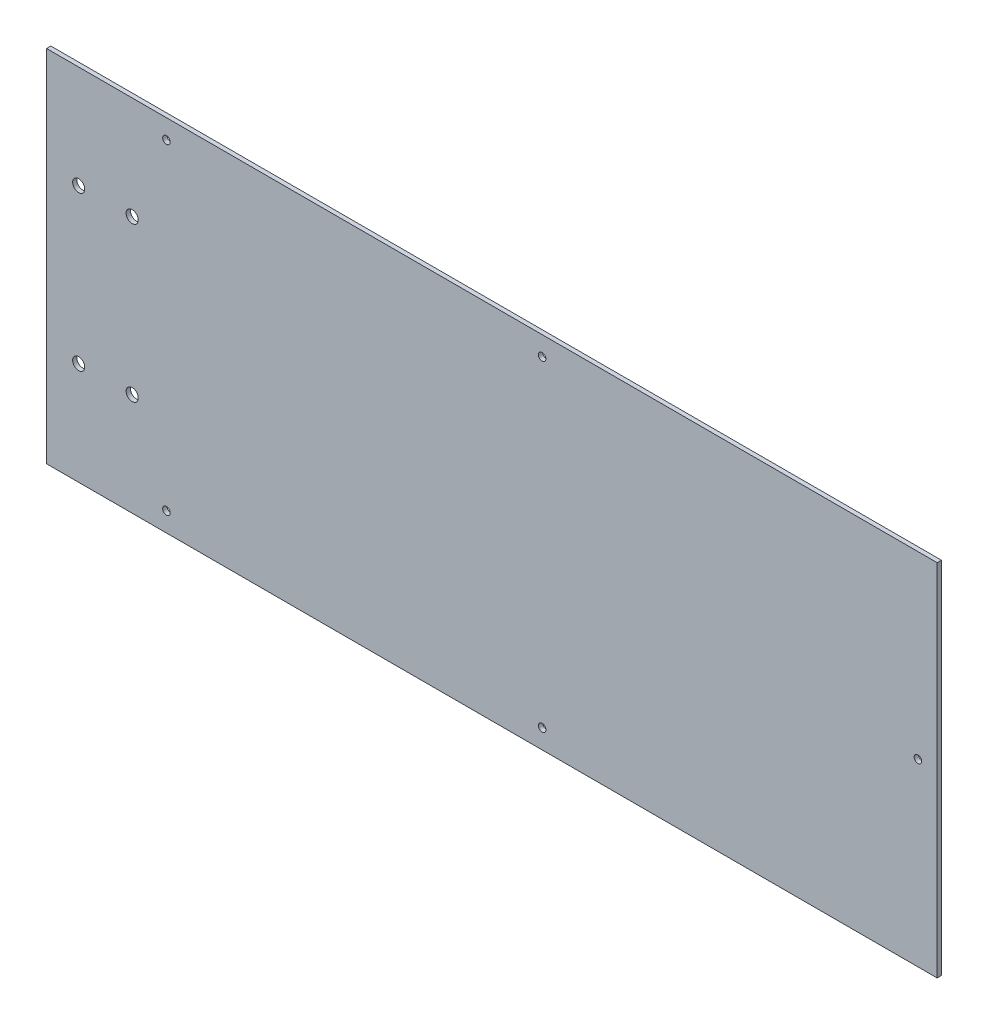
ISO-10303-21;
HEADER;
FILE_DESCRIPTION(('STEP AP214'),'2;1');
FILE_NAME('part.step','',(''),(''),'','','');
FILE_SCHEMA(('AUTOMOTIVE_DESIGN { 1 0 10303 214 1 1 1 1 }'));
ENDSEC;
DATA;
#1=APPLICATION_CONTEXT('core data for automotive mechanical design processes');
#2=APPLICATION_PROTOCOL_DEFINITION('international standard','automotive_design',2000,#1);
#3=PRODUCT_CONTEXT('',#1,'mechanical');
#4=PRODUCT('Part','Part','',(#3));
#5=PRODUCT_RELATED_PRODUCT_CATEGORY('part','',(#4));
#6=PRODUCT_DEFINITION_FORMATION('','',#4);
#7=PRODUCT_DEFINITION_CONTEXT('part definition',#1,'design');
#8=PRODUCT_DEFINITION('design','',#6,#7);
#9=PRODUCT_DEFINITION_SHAPE('','',#8);
#10=(LENGTH_UNIT() NAMED_UNIT(*) SI_UNIT(.MILLI.,.METRE.));
#11=(NAMED_UNIT(*) PLANE_ANGLE_UNIT() SI_UNIT($,.RADIAN.));
#12=(NAMED_UNIT(*) SI_UNIT($,.STERADIAN.) SOLID_ANGLE_UNIT());
#13=UNCERTAINTY_MEASURE_WITH_UNIT(LENGTH_MEASURE(1.E-05),#10,'distance_accuracy_value','');
#14=(GEOMETRIC_REPRESENTATION_CONTEXT(3) GLOBAL_UNCERTAINTY_ASSIGNED_CONTEXT((#13)) GLOBAL_UNIT_ASSIGNED_CONTEXT((#10,
#11,#12)) REPRESENTATION_CONTEXT('',''));
#15=CARTESIAN_POINT('',(0.,0.,0.));
#16=DIRECTION('',(0.,0.,1.));
#17=DIRECTION('',(1.,0.,0.));
#18=AXIS2_PLACEMENT_3D('',#15,#16,#17);
#19=CARTESIAN_POINT('',(0.,0.,1.5875));
#20=DIRECTION('',(0.,0.,-1.));
#21=DIRECTION('',(-1.,0.,0.));
#22=AXIS2_PLACEMENT_3D('',#19,#20,#21);
#23=PLANE('',#22);
#24=DIRECTION('',(0.,-1.,0.));
#25=VECTOR('',#24,1.);
#26=CARTESIAN_POINT('',(0.,0.,1.5875));
#27=LINE('',#26,#25);
#28=CARTESIAN_POINT('',(0.,133.35,1.5875));
#29=VERTEX_POINT('',#28);
#30=CARTESIAN_POINT('',(0.,0.,1.5875));
#31=VERTEX_POINT('',#30);
#32=EDGE_CURVE('E87',#29,#31,#27,.T.);
#33=ORIENTED_EDGE('',*,*,#32,.T.);
#34=DIRECTION('',(1.,0.,0.));
#35=VECTOR('',#34,1.);
#36=CARTESIAN_POINT('',(0.,0.,1.5875));
#37=LINE('',#36,#35);
#38=CARTESIAN_POINT('',(330.2,0.,1.5875));
#39=VERTEX_POINT('',#38);
#40=EDGE_CURVE('E82',#31,#39,#37,.T.);
#41=ORIENTED_EDGE('',*,*,#40,.T.);
#42=DIRECTION('',(0.,1.,0.));
#43=VECTOR('',#42,1.);
#44=CARTESIAN_POINT('',(330.2,0.,1.5875));
#45=LINE('',#44,#43);
#46=CARTESIAN_POINT('',(330.2,133.35,1.5875));
#47=VERTEX_POINT('',#46);
#48=EDGE_CURVE('E85',#39,#47,#45,.T.);
#49=ORIENTED_EDGE('',*,*,#48,.T.);
#50=DIRECTION('',(-1.,0.,0.));
#51=VECTOR('',#50,1.);
#52=CARTESIAN_POINT('',(0.,133.35,1.5875));
#53=LINE('',#52,#51);
#54=EDGE_CURVE('E52',#47,#29,#53,.T.);
#55=ORIENTED_EDGE('',*,*,#54,.T.);
#56=EDGE_LOOP('',(#33,#41,#49,#55));
#57=FACE_BOUND('',#56,.T.);
#58=CARTESIAN_POINT('',(323.0626,66.675,1.5875));
#59=DIRECTION('',(0.,0.,1.));
#60=DIRECTION('',(1.,0.,0.));
#61=AXIS2_PLACEMENT_3D('',#58,#59,#60);
#62=CIRCLE('',#61,1.39699999999999);
#63=CARTESIAN_POINT('',(324.4596,66.675,1.5875));
#64=VERTEX_POINT('',#63);
#65=EDGE_CURVE('E102',#64,#64,#62,.T.);
#66=ORIENTED_EDGE('',*,*,#65,.F.);
#67=EDGE_LOOP('',(#66));
#68=FACE_BOUND('',#67,.T.);
#69=CARTESIAN_POINT('',(183.7436,126.2126,1.5875));
#70=DIRECTION('',(0.,0.,1.));
#71=DIRECTION('',(1.,0.,0.));
#72=AXIS2_PLACEMENT_3D('',#69,#70,#71);
#73=CIRCLE('',#72,1.39699999999999);
#74=CARTESIAN_POINT('',(185.1406,126.2126,1.5875));
#75=VERTEX_POINT('',#74);
#76=EDGE_CURVE('E117',#75,#75,#73,.T.);
#77=ORIENTED_EDGE('',*,*,#76,.F.);
#78=EDGE_LOOP('',(#77));
#79=FACE_BOUND('',#78,.T.);
#80=CARTESIAN_POINT('',(44.45,126.2126,1.5875));
#81=DIRECTION('',(0.,0.,1.));
#82=DIRECTION('',(1.,0.,0.));
#83=AXIS2_PLACEMENT_3D('',#80,#81,#82);
#84=CIRCLE('',#83,1.397);
#85=CARTESIAN_POINT('',(45.847,126.2126,1.5875));
#86=VERTEX_POINT('',#85);
#87=EDGE_CURVE('E123',#86,#86,#84,.T.);
#88=ORIENTED_EDGE('',*,*,#87,.F.);
#89=EDGE_LOOP('',(#88));
#90=FACE_BOUND('',#89,.T.);
#91=CARTESIAN_POINT('',(183.7436,7.1374,1.5875));
#92=DIRECTION('',(0.,0.,1.));
#93=DIRECTION('',(1.,0.,0.));
#94=AXIS2_PLACEMENT_3D('',#91,#92,#93);
#95=CIRCLE('',#94,1.39699999999999);
#96=CARTESIAN_POINT('',(185.1406,7.1374,1.5875));
#97=VERTEX_POINT('',#96);
#98=EDGE_CURVE('E129',#97,#97,#95,.T.);
#99=ORIENTED_EDGE('',*,*,#98,.F.);
#100=EDGE_LOOP('',(#99));
#101=FACE_BOUND('',#100,.T.);
#102=CARTESIAN_POINT('',(44.45,7.1374,1.5875));
#103=DIRECTION('',(0.,0.,1.));
#104=DIRECTION('',(1.,0.,0.));
#105=AXIS2_PLACEMENT_3D('',#102,#103,#104);
#106=CIRCLE('',#105,1.39699999999999);
#107=CARTESIAN_POINT('',(45.847,7.1374,1.5875));
#108=VERTEX_POINT('',#107);
#109=EDGE_CURVE('E135',#108,#108,#106,.T.);
#110=ORIENTED_EDGE('',*,*,#109,.F.);
#111=EDGE_LOOP('',(#110));
#112=FACE_BOUND('',#111,.T.);
#113=CARTESIAN_POINT('',(31.75,95.25,1.5875));
#114=DIRECTION('',(0.,0.,1.));
#115=DIRECTION('',(1.,0.,0.));
#116=AXIS2_PLACEMENT_3D('',#113,#114,#115);
#117=CIRCLE('',#116,2.2479);
#118=CARTESIAN_POINT('',(33.9979,95.25,1.5875));
#119=VERTEX_POINT('',#118);
#120=EDGE_CURVE('E141',#119,#119,#117,.T.);
#121=ORIENTED_EDGE('',*,*,#120,.F.);
#122=EDGE_LOOP('',(#121));
#123=FACE_BOUND('',#122,.T.);
#124=CARTESIAN_POINT('',(11.9126,95.25,1.5875));
#125=DIRECTION('',(0.,0.,1.));
#126=DIRECTION('',(1.,0.,0.));
#127=AXIS2_PLACEMENT_3D('',#124,#125,#126);
#128=CIRCLE('',#127,2.2479);
#129=CARTESIAN_POINT('',(14.1605,95.25,1.5875));
#130=VERTEX_POINT('',#129);
#131=EDGE_CURVE('E147',#130,#130,#128,.T.);
#132=ORIENTED_EDGE('',*,*,#131,.F.);
#133=EDGE_LOOP('',(#132));
#134=FACE_BOUND('',#133,.T.);
#135=CARTESIAN_POINT('',(11.9126,38.1,1.5875));
#136=DIRECTION('',(0.,0.,1.));
#137=DIRECTION('',(1.,0.,0.));
#138=AXIS2_PLACEMENT_3D('',#135,#136,#137);
#139=CIRCLE('',#138,2.2479);
#140=CARTESIAN_POINT('',(14.1605,38.1,1.5875));
#141=VERTEX_POINT('',#140);
#142=EDGE_CURVE('E153',#141,#141,#139,.T.);
#143=ORIENTED_EDGE('',*,*,#142,.F.);
#144=EDGE_LOOP('',(#143));
#145=FACE_BOUND('',#144,.T.);
#146=CARTESIAN_POINT('',(31.75,38.1,1.5875));
#147=DIRECTION('',(0.,0.,1.));
#148=DIRECTION('',(1.,0.,0.));
#149=AXIS2_PLACEMENT_3D('',#146,#147,#148);
#150=CIRCLE('',#149,2.2479);
#151=CARTESIAN_POINT('',(33.9979,38.1,1.5875));
#152=VERTEX_POINT('',#151);
#153=EDGE_CURVE('E159',#152,#152,#150,.T.);
#154=ORIENTED_EDGE('',*,*,#153,.F.);
#155=EDGE_LOOP('',(#154));
#156=FACE_BOUND('',#155,.T.);
#157=ADVANCED_FACE('F35',(#57,#68,#79,#90,#101,#112,#123,#134,#145,#156),#23,.F.);
#158=CARTESIAN_POINT('',(0.,0.,0.));
#159=DIRECTION('',(0.,0.,-1.));
#160=DIRECTION('',(-1.,0.,0.));
#161=AXIS2_PLACEMENT_3D('',#158,#159,#160);
#162=PLANE('',#161);
#163=CARTESIAN_POINT('',(11.9126,38.1,0.));
#164=DIRECTION('',(0.,0.,1.));
#165=DIRECTION('',(1.,0.,0.));
#166=AXIS2_PLACEMENT_3D('',#163,#164,#165);
#167=CIRCLE('',#166,2.2479);
#168=CARTESIAN_POINT('',(14.1605,38.1,0.));
#169=VERTEX_POINT('',#168);
#170=EDGE_CURVE('E156',#169,#169,#167,.T.);
#171=ORIENTED_EDGE('',*,*,#170,.T.);
#172=EDGE_LOOP('',(#171));
#173=FACE_BOUND('',#172,.T.);
#174=CARTESIAN_POINT('',(31.75,95.25,0.));
#175=DIRECTION('',(0.,0.,1.));
#176=DIRECTION('',(1.,0.,0.));
#177=AXIS2_PLACEMENT_3D('',#174,#175,#176);
#178=CIRCLE('',#177,2.2479);
#179=CARTESIAN_POINT('',(33.9979,95.25,0.));
#180=VERTEX_POINT('',#179);
#181=EDGE_CURVE('E144',#180,#180,#178,.T.);
#182=ORIENTED_EDGE('',*,*,#181,.T.);
#183=EDGE_LOOP('',(#182));
#184=FACE_BOUND('',#183,.T.);
#185=CARTESIAN_POINT('',(183.7436,7.1374,0.));
#186=DIRECTION('',(0.,0.,1.));
#187=DIRECTION('',(1.,0.,0.));
#188=AXIS2_PLACEMENT_3D('',#185,#186,#187);
#189=CIRCLE('',#188,1.39699999999999);
#190=CARTESIAN_POINT('',(185.1406,7.1374,0.));
#191=VERTEX_POINT('',#190);
#192=EDGE_CURVE('E132',#191,#191,#189,.T.);
#193=ORIENTED_EDGE('',*,*,#192,.T.);
#194=EDGE_LOOP('',(#193));
#195=FACE_BOUND('',#194,.T.);
#196=CARTESIAN_POINT('',(183.7436,126.2126,0.));
#197=DIRECTION('',(0.,0.,1.));
#198=DIRECTION('',(1.,0.,0.));
#199=AXIS2_PLACEMENT_3D('',#196,#197,#198);
#200=CIRCLE('',#199,1.39699999999999);
#201=CARTESIAN_POINT('',(185.1406,126.2126,0.));
#202=VERTEX_POINT('',#201);
#203=EDGE_CURVE('E120',#202,#202,#200,.T.);
#204=ORIENTED_EDGE('',*,*,#203,.T.);
#205=EDGE_LOOP('',(#204));
#206=FACE_BOUND('',#205,.T.);
#207=DIRECTION('',(0.,-1.,0.));
#208=VECTOR('',#207,1.);
#209=CARTESIAN_POINT('',(0.,0.,0.));
#210=LINE('',#209,#208);
#211=CARTESIAN_POINT('',(0.,133.35,0.));
#212=VERTEX_POINT('',#211);
#213=CARTESIAN_POINT('',(0.,0.,0.));
#214=VERTEX_POINT('',#213);
#215=EDGE_CURVE('E99',#212,#214,#210,.T.);
#216=ORIENTED_EDGE('',*,*,#215,.F.);
#217=DIRECTION('',(-1.,0.,0.));
#218=VECTOR('',#217,1.);
#219=CARTESIAN_POINT('',(0.,133.35,0.));
#220=LINE('',#219,#218);
#221=CARTESIAN_POINT('',(330.2,133.35,0.));
#222=VERTEX_POINT('',#221);
#223=EDGE_CURVE('E75',#222,#212,#220,.T.);
#224=ORIENTED_EDGE('',*,*,#223,.F.);
#225=DIRECTION('',(0.,1.,0.));
#226=VECTOR('',#225,1.);
#227=CARTESIAN_POINT('',(330.2,0.,0.));
#228=LINE('',#227,#226);
#229=CARTESIAN_POINT('',(330.2,0.,0.));
#230=VERTEX_POINT('',#229);
#231=EDGE_CURVE('E69',#230,#222,#228,.T.);
#232=ORIENTED_EDGE('',*,*,#231,.F.);
#233=DIRECTION('',(1.,0.,0.));
#234=VECTOR('',#233,1.);
#235=CARTESIAN_POINT('',(0.,0.,0.));
#236=LINE('',#235,#234);
#237=EDGE_CURVE('E91',#214,#230,#236,.T.);
#238=ORIENTED_EDGE('',*,*,#237,.F.);
#239=EDGE_LOOP('',(#216,#224,#232,#238));
#240=FACE_BOUND('',#239,.T.);
#241=CARTESIAN_POINT('',(323.0626,66.675,0.));
#242=DIRECTION('',(0.,0.,1.));
#243=DIRECTION('',(1.,0.,0.));
#244=AXIS2_PLACEMENT_3D('',#241,#242,#243);
#245=CIRCLE('',#244,1.39699999999999);
#246=CARTESIAN_POINT('',(324.4596,66.675,0.));
#247=VERTEX_POINT('',#246);
#248=EDGE_CURVE('E114',#247,#247,#245,.T.);
#249=ORIENTED_EDGE('',*,*,#248,.T.);
#250=EDGE_LOOP('',(#249));
#251=FACE_BOUND('',#250,.T.);
#252=CARTESIAN_POINT('',(44.45,126.2126,0.));
#253=DIRECTION('',(0.,0.,1.));
#254=DIRECTION('',(1.,0.,0.));
#255=AXIS2_PLACEMENT_3D('',#252,#253,#254);
#256=CIRCLE('',#255,1.397);
#257=CARTESIAN_POINT('',(45.847,126.2126,0.));
#258=VERTEX_POINT('',#257);
#259=EDGE_CURVE('E126',#258,#258,#256,.T.);
#260=ORIENTED_EDGE('',*,*,#259,.T.);
#261=EDGE_LOOP('',(#260));
#262=FACE_BOUND('',#261,.T.);
#263=CARTESIAN_POINT('',(44.45,7.1374,0.));
#264=DIRECTION('',(0.,0.,1.));
#265=DIRECTION('',(1.,0.,0.));
#266=AXIS2_PLACEMENT_3D('',#263,#264,#265);
#267=CIRCLE('',#266,1.39699999999999);
#268=CARTESIAN_POINT('',(45.847,7.1374,0.));
#269=VERTEX_POINT('',#268);
#270=EDGE_CURVE('E138',#269,#269,#267,.T.);
#271=ORIENTED_EDGE('',*,*,#270,.T.);
#272=EDGE_LOOP('',(#271));
#273=FACE_BOUND('',#272,.T.);
#274=CARTESIAN_POINT('',(11.9126,95.25,0.));
#275=DIRECTION('',(0.,0.,1.));
#276=DIRECTION('',(1.,0.,0.));
#277=AXIS2_PLACEMENT_3D('',#274,#275,#276);
#278=CIRCLE('',#277,2.2479);
#279=CARTESIAN_POINT('',(14.1605,95.25,0.));
#280=VERTEX_POINT('',#279);
#281=EDGE_CURVE('E150',#280,#280,#278,.T.);
#282=ORIENTED_EDGE('',*,*,#281,.T.);
#283=EDGE_LOOP('',(#282));
#284=FACE_BOUND('',#283,.T.);
#285=CARTESIAN_POINT('',(31.75,38.1,0.));
#286=DIRECTION('',(0.,0.,1.));
#287=DIRECTION('',(1.,0.,0.));
#288=AXIS2_PLACEMENT_3D('',#285,#286,#287);
#289=CIRCLE('',#288,2.2479);
#290=CARTESIAN_POINT('',(33.9979,38.1,0.));
#291=VERTEX_POINT('',#290);
#292=EDGE_CURVE('E162',#291,#291,#289,.T.);
#293=ORIENTED_EDGE('',*,*,#292,.T.);
#294=EDGE_LOOP('',(#293));
#295=FACE_BOUND('',#294,.T.);
#296=ADVANCED_FACE('F110',(#173,#184,#195,#206,#240,#251,#262,#273,#284,#295),#162,.T.);
#297=CARTESIAN_POINT('',(0.,0.,1.5875));
#298=DIRECTION('',(1.,0.,0.));
#299=DIRECTION('',(0.,0.,-1.));
#300=AXIS2_PLACEMENT_3D('',#297,#298,#299);
#301=PLANE('',#300);
#302=ORIENTED_EDGE('',*,*,#215,.T.);
#303=DIRECTION('',(0.,0.,-1.));
#304=VECTOR('',#303,1.);
#305=CARTESIAN_POINT('',(0.,0.,1.5875));
#306=LINE('',#305,#304);
#307=EDGE_CURVE('E11',#31,#214,#306,.T.);
#308=ORIENTED_EDGE('',*,*,#307,.F.);
#309=ORIENTED_EDGE('',*,*,#32,.F.);
#310=DIRECTION('',(0.,0.,-1.));
#311=VECTOR('',#310,1.);
#312=CARTESIAN_POINT('',(0.,133.35,1.5875));
#313=LINE('',#312,#311);
#314=EDGE_CURVE('E95',#29,#212,#313,.T.);
#315=ORIENTED_EDGE('',*,*,#314,.T.);
#316=EDGE_LOOP('',(#302,#308,#309,#315));
#317=FACE_BOUND('',#316,.T.);
#318=ADVANCED_FACE('F37',(#317),#301,.F.);
#319=CARTESIAN_POINT('',(0.,0.,1.5875));
#320=DIRECTION('',(0.,1.,0.));
#321=DIRECTION('',(0.,0.,1.));
#322=AXIS2_PLACEMENT_3D('',#319,#320,#321);
#323=PLANE('',#322);
#324=ORIENTED_EDGE('',*,*,#237,.T.);
#325=DIRECTION('',(0.,0.,-1.));
#326=VECTOR('',#325,1.);
#327=CARTESIAN_POINT('',(330.2,0.,1.5875));
#328=LINE('',#327,#326);
#329=EDGE_CURVE('E44',#39,#230,#328,.T.);
#330=ORIENTED_EDGE('',*,*,#329,.F.);
#331=ORIENTED_EDGE('',*,*,#40,.F.);
#332=ORIENTED_EDGE('',*,*,#307,.T.);
#333=EDGE_LOOP('',(#324,#330,#331,#332));
#334=FACE_BOUND('',#333,.T.);
#335=ADVANCED_FACE('F90',(#334),#323,.F.);
#336=CARTESIAN_POINT('',(330.2,0.,1.5875));
#337=DIRECTION('',(-1.,0.,0.));
#338=DIRECTION('',(0.,0.,1.));
#339=AXIS2_PLACEMENT_3D('',#336,#337,#338);
#340=PLANE('',#339);
#341=ORIENTED_EDGE('',*,*,#231,.T.);
#342=DIRECTION('',(0.,0.,-1.));
#343=VECTOR('',#342,1.);
#344=CARTESIAN_POINT('',(330.2,133.35,1.5875));
#345=LINE('',#344,#343);
#346=EDGE_CURVE('E92',#47,#222,#345,.T.);
#347=ORIENTED_EDGE('',*,*,#346,.F.);
#348=ORIENTED_EDGE('',*,*,#48,.F.);
#349=ORIENTED_EDGE('',*,*,#329,.T.);
#350=EDGE_LOOP('',(#341,#347,#348,#349));
#351=FACE_BOUND('',#350,.T.);
#352=ADVANCED_FACE('F93',(#351),#340,.F.);
#353=CARTESIAN_POINT('',(0.,133.35,1.5875));
#354=DIRECTION('',(0.,-1.,0.));
#355=DIRECTION('',(0.,0.,-1.));
#356=AXIS2_PLACEMENT_3D('',#353,#354,#355);
#357=PLANE('',#356);
#358=ORIENTED_EDGE('',*,*,#223,.T.);
#359=ORIENTED_EDGE('',*,*,#314,.F.);
#360=ORIENTED_EDGE('',*,*,#54,.F.);
#361=ORIENTED_EDGE('',*,*,#346,.T.);
#362=EDGE_LOOP('',(#358,#359,#360,#361));
#363=FACE_BOUND('',#362,.T.);
#364=ADVANCED_FACE('F107',(#363),#357,.F.);
#365=CARTESIAN_POINT('',(323.0626,66.675,1.5875));
#366=DIRECTION('',(0.,0.,-1.));
#367=DIRECTION('',(-1.,0.,0.));
#368=AXIS2_PLACEMENT_3D('',#365,#366,#367);
#369=CYLINDRICAL_SURFACE('',#368,1.39699999999999);
#370=ORIENTED_EDGE('',*,*,#65,.T.);
#371=EDGE_LOOP('',(#370));
#372=FACE_BOUND('',#371,.T.);
#373=ORIENTED_EDGE('',*,*,#248,.F.);
#374=EDGE_LOOP('',(#373));
#375=FACE_BOUND('',#374,.T.);
#376=ADVANCED_FACE('F179',(#372,#375),#369,.F.);
#377=CARTESIAN_POINT('',(183.7436,126.2126,1.5875));
#378=DIRECTION('',(0.,0.,-1.));
#379=DIRECTION('',(-1.,0.,0.));
#380=AXIS2_PLACEMENT_3D('',#377,#378,#379);
#381=CYLINDRICAL_SURFACE('',#380,1.39699999999999);
#382=ORIENTED_EDGE('',*,*,#76,.T.);
#383=EDGE_LOOP('',(#382));
#384=FACE_BOUND('',#383,.T.);
#385=ORIENTED_EDGE('',*,*,#203,.F.);
#386=EDGE_LOOP('',(#385));
#387=FACE_BOUND('',#386,.T.);
#388=ADVANCED_FACE('F227',(#384,#387),#381,.F.);
#389=CARTESIAN_POINT('',(44.45,126.2126,1.5875));
#390=DIRECTION('',(0.,0.,-1.));
#391=DIRECTION('',(-1.,0.,0.));
#392=AXIS2_PLACEMENT_3D('',#389,#390,#391);
#393=CYLINDRICAL_SURFACE('',#392,1.397);
#394=ORIENTED_EDGE('',*,*,#87,.T.);
#395=EDGE_LOOP('',(#394));
#396=FACE_BOUND('',#395,.T.);
#397=ORIENTED_EDGE('',*,*,#259,.F.);
#398=EDGE_LOOP('',(#397));
#399=FACE_BOUND('',#398,.T.);
#400=ADVANCED_FACE('F235',(#396,#399),#393,.F.);
#401=CARTESIAN_POINT('',(183.7436,7.1374,1.5875));
#402=DIRECTION('',(0.,0.,-1.));
#403=DIRECTION('',(-1.,0.,0.));
#404=AXIS2_PLACEMENT_3D('',#401,#402,#403);
#405=CYLINDRICAL_SURFACE('',#404,1.39699999999999);
#406=ORIENTED_EDGE('',*,*,#98,.T.);
#407=EDGE_LOOP('',(#406));
#408=FACE_BOUND('',#407,.T.);
#409=ORIENTED_EDGE('',*,*,#192,.F.);
#410=EDGE_LOOP('',(#409));
#411=FACE_BOUND('',#410,.T.);
#412=ADVANCED_FACE('F243',(#408,#411),#405,.F.);
#413=CARTESIAN_POINT('',(44.45,7.1374,1.5875));
#414=DIRECTION('',(0.,0.,-1.));
#415=DIRECTION('',(-1.,0.,0.));
#416=AXIS2_PLACEMENT_3D('',#413,#414,#415);
#417=CYLINDRICAL_SURFACE('',#416,1.39699999999999);
#418=ORIENTED_EDGE('',*,*,#109,.T.);
#419=EDGE_LOOP('',(#418));
#420=FACE_BOUND('',#419,.T.);
#421=ORIENTED_EDGE('',*,*,#270,.F.);
#422=EDGE_LOOP('',(#421));
#423=FACE_BOUND('',#422,.T.);
#424=ADVANCED_FACE('F252',(#420,#423),#417,.F.);
#425=CARTESIAN_POINT('',(31.75,95.25,1.5875));
#426=DIRECTION('',(0.,0.,-1.));
#427=DIRECTION('',(-1.,0.,0.));
#428=AXIS2_PLACEMENT_3D('',#425,#426,#427);
#429=CYLINDRICAL_SURFACE('',#428,2.2479);
#430=ORIENTED_EDGE('',*,*,#120,.T.);
#431=EDGE_LOOP('',(#430));
#432=FACE_BOUND('',#431,.T.);
#433=ORIENTED_EDGE('',*,*,#181,.F.);
#434=EDGE_LOOP('',(#433));
#435=FACE_BOUND('',#434,.T.);
#436=ADVANCED_FACE('F261',(#432,#435),#429,.F.);
#437=CARTESIAN_POINT('',(11.9126,95.25,1.5875));
#438=DIRECTION('',(0.,0.,-1.));
#439=DIRECTION('',(-1.,0.,0.));
#440=AXIS2_PLACEMENT_3D('',#437,#438,#439);
#441=CYLINDRICAL_SURFACE('',#440,2.2479);
#442=ORIENTED_EDGE('',*,*,#131,.T.);
#443=EDGE_LOOP('',(#442));
#444=FACE_BOUND('',#443,.T.);
#445=ORIENTED_EDGE('',*,*,#281,.F.);
#446=EDGE_LOOP('',(#445));
#447=FACE_BOUND('',#446,.T.);
#448=ADVANCED_FACE('F270',(#444,#447),#441,.F.);
#449=CARTESIAN_POINT('',(11.9126,38.1,1.5875));
#450=DIRECTION('',(0.,0.,-1.));
#451=DIRECTION('',(-1.,0.,0.));
#452=AXIS2_PLACEMENT_3D('',#449,#450,#451);
#453=CYLINDRICAL_SURFACE('',#452,2.2479);
#454=ORIENTED_EDGE('',*,*,#142,.T.);
#455=EDGE_LOOP('',(#454));
#456=FACE_BOUND('',#455,.T.);
#457=ORIENTED_EDGE('',*,*,#170,.F.);
#458=EDGE_LOOP('',(#457));
#459=FACE_BOUND('',#458,.T.);
#460=ADVANCED_FACE('F279',(#456,#459),#453,.F.);
#461=CARTESIAN_POINT('',(31.75,38.1,1.5875));
#462=DIRECTION('',(0.,0.,-1.));
#463=DIRECTION('',(-1.,0.,0.));
#464=AXIS2_PLACEMENT_3D('',#461,#462,#463);
#465=CYLINDRICAL_SURFACE('',#464,2.2479);
#466=ORIENTED_EDGE('',*,*,#153,.T.);
#467=EDGE_LOOP('',(#466));
#468=FACE_BOUND('',#467,.T.);
#469=ORIENTED_EDGE('',*,*,#292,.F.);
#470=EDGE_LOOP('',(#469));
#471=FACE_BOUND('',#470,.T.);
#472=ADVANCED_FACE('F168',(#468,#471),#465,.F.);
#473=CLOSED_SHELL('',(#157,#296,#318,#335,#352,#364,#376,#388,#400,#412,#424,#436,#448,#460,#472));
#474=MANIFOLD_SOLID_BREP('B2',#473);
#475=ADVANCED_BREP_SHAPE_REPRESENTATION('',(#18,#474),#14);
#476=SHAPE_DEFINITION_REPRESENTATION(#9,#475);
ENDSEC;
END-ISO-10303-21;
